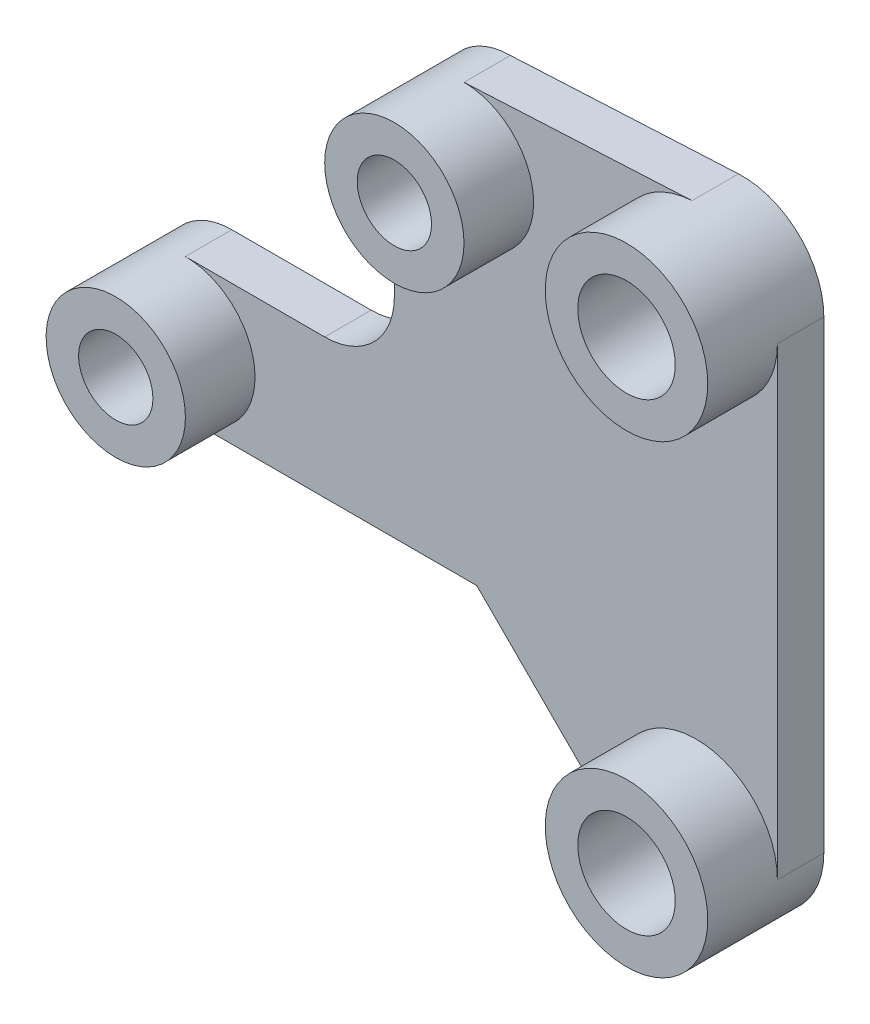
ISO-10303-21;
HEADER;
FILE_DESCRIPTION(('STEP AP214'),'2;1');
FILE_NAME('part.step','',(''),(''),'','','');
FILE_SCHEMA(('AUTOMOTIVE_DESIGN { 1 0 10303 214 1 1 1 1 }'));
ENDSEC;
DATA;
#1=APPLICATION_CONTEXT('core data for automotive mechanical design processes');
#2=APPLICATION_PROTOCOL_DEFINITION('international standard','automotive_design',2000,#1);
#3=PRODUCT_CONTEXT('',#1,'mechanical');
#4=PRODUCT('Part','Part','',(#3));
#5=PRODUCT_RELATED_PRODUCT_CATEGORY('part','',(#4));
#6=PRODUCT_DEFINITION_FORMATION('','',#4);
#7=PRODUCT_DEFINITION_CONTEXT('part definition',#1,'design');
#8=PRODUCT_DEFINITION('design','',#6,#7);
#9=PRODUCT_DEFINITION_SHAPE('','',#8);
#10=(LENGTH_UNIT() NAMED_UNIT(*) SI_UNIT(.MILLI.,.METRE.));
#11=(NAMED_UNIT(*) PLANE_ANGLE_UNIT() SI_UNIT($,.RADIAN.));
#12=(NAMED_UNIT(*) SI_UNIT($,.STERADIAN.) SOLID_ANGLE_UNIT());
#13=UNCERTAINTY_MEASURE_WITH_UNIT(LENGTH_MEASURE(1.E-05),#10,'distance_accuracy_value','');
#14=(GEOMETRIC_REPRESENTATION_CONTEXT(3) GLOBAL_UNCERTAINTY_ASSIGNED_CONTEXT((#13)) GLOBAL_UNIT_ASSIGNED_CONTEXT((#10,
#11,#12)) REPRESENTATION_CONTEXT('',''));
#15=CARTESIAN_POINT('',(0.,0.,0.));
#16=DIRECTION('',(0.,0.,1.));
#17=DIRECTION('',(1.,0.,0.));
#18=AXIS2_PLACEMENT_3D('',#15,#16,#17);
#19=CARTESIAN_POINT('',(22.,-7.5,2.));
#20=DIRECTION('',(0.,0.,1.));
#21=DIRECTION('',(1.,0.,0.));
#22=AXIS2_PLACEMENT_3D('',#19,#20,#21);
#23=PLANE('',#22);
#24=DIRECTION('',(0.707106781186546,-0.707106781186549,0.));
#25=VECTOR('',#24,1.);
#26=CARTESIAN_POINT('',(12.5502525316942,-3.,2.));
#27=LINE('',#26,#25);
#28=CARTESIAN_POINT('',(12.5502525316942,-3.,2.));
#29=VERTEX_POINT('',#28);
#30=CARTESIAN_POINT('',(19.5251262658471,-9.9748737341529,2.));
#31=VERTEX_POINT('',#30);
#32=EDGE_CURVE('E52',#29,#31,#27,.T.);
#33=ORIENTED_EDGE('',*,*,#32,.T.);
#34=CARTESIAN_POINT('',(22.,-7.5,2.));
#35=DIRECTION('',(0.,0.,1.));
#36=DIRECTION('',(1.,0.,0.));
#37=AXIS2_PLACEMENT_3D('',#34,#35,#36);
#38=CIRCLE('',#37,3.5);
#39=CARTESIAN_POINT('',(25.5,-7.5,2.));
#40=VERTEX_POINT('',#39);
#41=EDGE_CURVE('E218',#40,#31,#38,.T.);
#42=ORIENTED_EDGE('',*,*,#41,.F.);
#43=DIRECTION('',(0.,1.,0.));
#44=VECTOR('',#43,1.);
#45=CARTESIAN_POINT('',(25.5,12.5,2.));
#46=LINE('',#45,#44);
#47=CARTESIAN_POINT('',(25.5,12.5,2.));
#48=VERTEX_POINT('',#47);
#49=EDGE_CURVE('E103',#40,#48,#46,.T.);
#50=ORIENTED_EDGE('',*,*,#49,.T.);
#51=CARTESIAN_POINT('',(22.,12.5,2.));
#52=DIRECTION('',(0.,0.,1.));
#53=DIRECTION('',(1.,0.,0.));
#54=AXIS2_PLACEMENT_3D('',#51,#52,#53);
#55=CIRCLE('',#54,3.5);
#56=CARTESIAN_POINT('',(21.8236665757592,15.9955552525308,2.));
#57=VERTEX_POINT('',#56);
#58=EDGE_CURVE('E11',#48,#57,#55,.F.);
#59=ORIENTED_EDGE('',*,*,#58,.T.);
#60=DIRECTION('',(-0.998730072151651,-0.0503809783545027,0.));
#61=VECTOR('',#60,1.);
#62=CARTESIAN_POINT('',(12.,15.5,2.));
#63=LINE('',#62,#61);
#64=CARTESIAN_POINT('',(12.,15.5,2.));
#65=VERTEX_POINT('',#64);
#66=EDGE_CURVE('E195',#57,#65,#63,.T.);
#67=ORIENTED_EDGE('',*,*,#66,.T.);
#68=CARTESIAN_POINT('',(12.,12.5,2.));
#69=DIRECTION('',(0.,0.,1.));
#70=DIRECTION('',(1.,0.,0.));
#71=AXIS2_PLACEMENT_3D('',#68,#69,#70);
#72=CIRCLE('',#71,3.);
#73=CARTESIAN_POINT('',(9.,12.5,2.));
#74=VERTEX_POINT('',#73);
#75=EDGE_CURVE('E44',#65,#74,#72,.F.);
#76=ORIENTED_EDGE('',*,*,#75,.T.);
#77=DIRECTION('',(0.,-1.,0.));
#78=VECTOR('',#77,1.);
#79=CARTESIAN_POINT('',(9.,6.,2.));
#80=LINE('',#79,#78);
#81=CARTESIAN_POINT('',(9.,6.,2.));
#82=VERTEX_POINT('',#81);
#83=EDGE_CURVE('E191',#74,#82,#80,.T.);
#84=ORIENTED_EDGE('',*,*,#83,.T.);
#85=CARTESIAN_POINT('',(6.,6.,2.));
#86=DIRECTION('',(0.,0.,-1.));
#87=DIRECTION('',(1.,0.,0.));
#88=AXIS2_PLACEMENT_3D('',#85,#86,#87);
#89=CIRCLE('',#88,3.);
#90=CARTESIAN_POINT('',(6.,3.,2.));
#91=VERTEX_POINT('',#90);
#92=EDGE_CURVE('E140',#82,#91,#89,.T.);
#93=ORIENTED_EDGE('',*,*,#92,.T.);
#94=DIRECTION('',(-1.,0.,0.));
#95=VECTOR('',#94,1.);
#96=CARTESIAN_POINT('',(0.,3.,2.));
#97=LINE('',#96,#95);
#98=CARTESIAN_POINT('',(0.,3.,2.));
#99=VERTEX_POINT('',#98);
#100=EDGE_CURVE('E123',#91,#99,#97,.T.);
#101=ORIENTED_EDGE('',*,*,#100,.T.);
#102=CARTESIAN_POINT('',(0.,0.,2.));
#103=DIRECTION('',(0.,0.,1.));
#104=DIRECTION('',(1.,0.,0.));
#105=AXIS2_PLACEMENT_3D('',#102,#103,#104);
#106=CIRCLE('',#105,3.);
#107=CARTESIAN_POINT('',(0.,-3.,2.));
#108=VERTEX_POINT('',#107);
#109=EDGE_CURVE('E118',#108,#99,#106,.T.);
#110=ORIENTED_EDGE('',*,*,#109,.F.);
#111=DIRECTION('',(1.,0.,0.));
#112=VECTOR('',#111,1.);
#113=CARTESIAN_POINT('',(0.,-3.,2.));
#114=LINE('',#113,#112);
#115=EDGE_CURVE('E121',#108,#29,#114,.T.);
#116=ORIENTED_EDGE('',*,*,#115,.T.);
#117=EDGE_LOOP('',(#33,#42,#50,#59,#67,#76,#84,#93,#101,#110,#116));
#118=FACE_BOUND('',#117,.T.);
#119=ADVANCED_FACE('F35',(#118),#23,.T.);
#120=CARTESIAN_POINT('',(22.,-7.5,2.));
#121=DIRECTION('',(0.,0.,-1.));
#122=DIRECTION('',(-1.,0.,0.));
#123=AXIS2_PLACEMENT_3D('',#120,#121,#122);
#124=CYLINDRICAL_SURFACE('',#123,3.49999999999998);
#125=CARTESIAN_POINT('',(22.,-7.5,0.));
#126=DIRECTION('',(0.,0.,1.));
#127=DIRECTION('',(1.,0.,0.));
#128=AXIS2_PLACEMENT_3D('',#125,#126,#127);
#129=CIRCLE('',#128,3.49999999999998);
#130=CARTESIAN_POINT('',(19.5251262658471,-9.9748737341529,0.));
#131=VERTEX_POINT('',#130);
#132=CARTESIAN_POINT('',(25.5,-7.5,0.));
#133=VERTEX_POINT('',#132);
#134=EDGE_CURVE('E144',#131,#133,#129,.T.);
#135=ORIENTED_EDGE('',*,*,#134,.T.);
#136=DIRECTION('',(0.,0.,-1.));
#137=VECTOR('',#136,1.);
#138=CARTESIAN_POINT('',(25.5,-7.5,2.));
#139=LINE('',#138,#137);
#140=EDGE_CURVE('E126',#40,#133,#139,.T.);
#141=ORIENTED_EDGE('',*,*,#140,.F.);
#142=ORIENTED_EDGE('',*,*,#41,.T.);
#143=DIRECTION('',(0.,0.,-1.));
#144=VECTOR('',#143,1.);
#145=CARTESIAN_POINT('',(19.5251262658471,-9.9748737341529,2.));
#146=LINE('',#145,#144);
#147=EDGE_CURVE('E138',#31,#131,#146,.T.);
#148=ORIENTED_EDGE('',*,*,#147,.T.);
#149=EDGE_LOOP('',(#135,#141,#142,#148));
#150=FACE_BOUND('',#149,.T.);
#151=CARTESIAN_POINT('',(22.,-7.5,5.));
#152=DIRECTION('',(0.,0.,1.));
#153=DIRECTION('',(1.,0.,0.));
#154=AXIS2_PLACEMENT_3D('',#151,#152,#153);
#155=CIRCLE('',#154,3.5);
#156=CARTESIAN_POINT('',(25.5,-7.5,5.));
#157=VERTEX_POINT('',#156);
#158=EDGE_CURVE('E217',#157,#157,#155,.T.);
#159=ORIENTED_EDGE('',*,*,#158,.F.);
#160=EDGE_LOOP('',(#159));
#161=FACE_BOUND('',#160,.T.);
#162=ADVANCED_FACE('F37',(#150,#161),#124,.T.);
#163=CARTESIAN_POINT('',(25.5,12.5,2.));
#164=DIRECTION('',(-1.,0.,0.));
#165=DIRECTION('',(0.,-1.,0.));
#166=AXIS2_PLACEMENT_3D('',#163,#164,#165);
#167=PLANE('',#166);
#168=DIRECTION('',(0.,1.,0.));
#169=VECTOR('',#168,1.);
#170=CARTESIAN_POINT('',(25.5,12.5,0.));
#171=LINE('',#170,#169);
#172=CARTESIAN_POINT('',(25.5,12.5,0.));
#173=VERTEX_POINT('',#172);
#174=EDGE_CURVE('E147',#133,#173,#171,.T.);
#175=ORIENTED_EDGE('',*,*,#174,.T.);
#176=DIRECTION('',(0.,0.,-1.));
#177=VECTOR('',#176,1.);
#178=CARTESIAN_POINT('',(25.5,12.5,2.));
#179=LINE('',#178,#177);
#180=EDGE_CURVE('E183',#48,#173,#179,.T.);
#181=ORIENTED_EDGE('',*,*,#180,.F.);
#182=ORIENTED_EDGE('',*,*,#49,.F.);
#183=ORIENTED_EDGE('',*,*,#140,.T.);
#184=EDGE_LOOP('',(#175,#181,#182,#183));
#185=FACE_BOUND('',#184,.T.);
#186=ADVANCED_FACE('F281',(#185),#167,.F.);
#187=CARTESIAN_POINT('',(22.,12.5,2.));
#188=DIRECTION('',(0.,0.,-1.));
#189=DIRECTION('',(-1.,0.,0.));
#190=AXIS2_PLACEMENT_3D('',#187,#188,#189);
#191=CYLINDRICAL_SURFACE('',#190,3.49999999999998);
#192=CARTESIAN_POINT('',(22.,12.5,0.));
#193=DIRECTION('',(0.,0.,1.));
#194=DIRECTION('',(1.,0.,0.));
#195=AXIS2_PLACEMENT_3D('',#192,#193,#194);
#196=CIRCLE('',#195,3.49999999999998);
#197=CARTESIAN_POINT('',(21.8236665757592,15.9955552525308,0.));
#198=VERTEX_POINT('',#197);
#199=EDGE_CURVE('E150',#173,#198,#196,.T.);
#200=ORIENTED_EDGE('',*,*,#199,.T.);
#201=DIRECTION('',(0.,0.,-1.));
#202=VECTOR('',#201,1.);
#203=CARTESIAN_POINT('',(21.8236665757592,15.9955552525308,2.));
#204=LINE('',#203,#202);
#205=EDGE_CURVE('E180',#57,#198,#204,.T.);
#206=ORIENTED_EDGE('',*,*,#205,.F.);
#207=ORIENTED_EDGE('',*,*,#58,.F.);
#208=ORIENTED_EDGE('',*,*,#180,.T.);
#209=EDGE_LOOP('',(#200,#206,#207,#208));
#210=FACE_BOUND('',#209,.T.);
#211=CARTESIAN_POINT('',(22.,12.5,5.));
#212=DIRECTION('',(0.,0.,1.));
#213=DIRECTION('',(1.,0.,0.));
#214=AXIS2_PLACEMENT_3D('',#211,#212,#213);
#215=CIRCLE('',#214,3.5);
#216=CARTESIAN_POINT('',(25.5,12.5,5.));
#217=VERTEX_POINT('',#216);
#218=EDGE_CURVE('E214',#217,#217,#215,.T.);
#219=ORIENTED_EDGE('',*,*,#218,.F.);
#220=EDGE_LOOP('',(#219));
#221=FACE_BOUND('',#220,.T.);
#222=ADVANCED_FACE('F392',(#210,#221),#191,.T.);
#223=CARTESIAN_POINT('',(12.,15.5,2.));
#224=DIRECTION('',(0.0503809783545027,-0.998730072151652,0.));
#225=DIRECTION('',(0.998730072151652,0.0503809783545027,0.));
#226=AXIS2_PLACEMENT_3D('',#223,#224,#225);
#227=PLANE('',#226);
#228=DIRECTION('',(-0.998730072151651,-0.0503809783545027,0.));
#229=VECTOR('',#228,1.);
#230=CARTESIAN_POINT('',(12.,15.5,0.));
#231=LINE('',#230,#229);
#232=CARTESIAN_POINT('',(12.,15.5,0.));
#233=VERTEX_POINT('',#232);
#234=EDGE_CURVE('E152',#198,#233,#231,.T.);
#235=ORIENTED_EDGE('',*,*,#234,.T.);
#236=DIRECTION('',(0.,0.,-1.));
#237=VECTOR('',#236,1.);
#238=CARTESIAN_POINT('',(12.,15.5,2.));
#239=LINE('',#238,#237);
#240=EDGE_CURVE('E177',#65,#233,#239,.T.);
#241=ORIENTED_EDGE('',*,*,#240,.F.);
#242=ORIENTED_EDGE('',*,*,#66,.F.);
#243=ORIENTED_EDGE('',*,*,#205,.T.);
#244=EDGE_LOOP('',(#235,#241,#242,#243));
#245=FACE_BOUND('',#244,.T.);
#246=ADVANCED_FACE('F384',(#245),#227,.F.);
#247=CARTESIAN_POINT('',(12.,12.5,2.));
#248=DIRECTION('',(0.,0.,-1.));
#249=DIRECTION('',(-1.,0.,0.));
#250=AXIS2_PLACEMENT_3D('',#247,#248,#249);
#251=CYLINDRICAL_SURFACE('',#250,3.);
#252=CARTESIAN_POINT('',(12.,12.5,0.));
#253=DIRECTION('',(0.,0.,1.));
#254=DIRECTION('',(1.,0.,0.));
#255=AXIS2_PLACEMENT_3D('',#252,#253,#254);
#256=CIRCLE('',#255,3.);
#257=CARTESIAN_POINT('',(9.,12.5,0.));
#258=VERTEX_POINT('',#257);
#259=EDGE_CURVE('E154',#233,#258,#256,.T.);
#260=ORIENTED_EDGE('',*,*,#259,.T.);
#261=DIRECTION('',(0.,0.,-1.));
#262=VECTOR('',#261,1.);
#263=CARTESIAN_POINT('',(9.,12.5,2.));
#264=LINE('',#263,#262);
#265=EDGE_CURVE('E174',#74,#258,#264,.T.);
#266=ORIENTED_EDGE('',*,*,#265,.F.);
#267=ORIENTED_EDGE('',*,*,#75,.F.);
#268=ORIENTED_EDGE('',*,*,#240,.T.);
#269=EDGE_LOOP('',(#260,#266,#267,#268));
#270=FACE_BOUND('',#269,.T.);
#271=CARTESIAN_POINT('',(12.,12.5,5.));
#272=DIRECTION('',(0.,0.,1.));
#273=DIRECTION('',(1.,0.,0.));
#274=AXIS2_PLACEMENT_3D('',#271,#272,#273);
#275=CIRCLE('',#274,3.);
#276=CARTESIAN_POINT('',(15.,12.5,5.));
#277=VERTEX_POINT('',#276);
#278=EDGE_CURVE('E211',#277,#277,#275,.T.);
#279=ORIENTED_EDGE('',*,*,#278,.F.);
#280=EDGE_LOOP('',(#279));
#281=FACE_BOUND('',#280,.T.);
#282=ADVANCED_FACE('F198',(#270,#281),#251,.T.);
#283=CARTESIAN_POINT('',(9.,6.,2.));
#284=DIRECTION('',(1.,0.,0.));
#285=DIRECTION('',(0.,1.,0.));
#286=AXIS2_PLACEMENT_3D('',#283,#284,#285);
#287=PLANE('',#286);
#288=DIRECTION('',(0.,-1.,0.));
#289=VECTOR('',#288,1.);
#290=CARTESIAN_POINT('',(9.,6.,0.));
#291=LINE('',#290,#289);
#292=CARTESIAN_POINT('',(9.,6.,0.));
#293=VERTEX_POINT('',#292);
#294=EDGE_CURVE('E156',#258,#293,#291,.T.);
#295=ORIENTED_EDGE('',*,*,#294,.T.);
#296=DIRECTION('',(0.,0.,-1.));
#297=VECTOR('',#296,1.);
#298=CARTESIAN_POINT('',(9.,6.,2.));
#299=LINE('',#298,#297);
#300=EDGE_CURVE('E171',#82,#293,#299,.T.);
#301=ORIENTED_EDGE('',*,*,#300,.F.);
#302=ORIENTED_EDGE('',*,*,#83,.F.);
#303=ORIENTED_EDGE('',*,*,#265,.T.);
#304=EDGE_LOOP('',(#295,#301,#302,#303));
#305=FACE_BOUND('',#304,.T.);
#306=ADVANCED_FACE('F203',(#305),#287,.F.);
#307=CARTESIAN_POINT('',(6.,6.,2.));
#308=DIRECTION('',(0.,0.,-1.));
#309=DIRECTION('',(-1.,0.,0.));
#310=AXIS2_PLACEMENT_3D('',#307,#308,#309);
#311=CYLINDRICAL_SURFACE('',#310,3.);
#312=CARTESIAN_POINT('',(6.,6.,0.));
#313=DIRECTION('',(0.,0.,-1.));
#314=DIRECTION('',(1.,0.,0.));
#315=AXIS2_PLACEMENT_3D('',#312,#313,#314);
#316=CIRCLE('',#315,3.);
#317=CARTESIAN_POINT('',(6.,3.,0.));
#318=VERTEX_POINT('',#317);
#319=EDGE_CURVE('E158',#293,#318,#316,.T.);
#320=ORIENTED_EDGE('',*,*,#319,.T.);
#321=DIRECTION('',(0.,0.,-1.));
#322=VECTOR('',#321,1.);
#323=CARTESIAN_POINT('',(6.,3.,2.));
#324=LINE('',#323,#322);
#325=EDGE_CURVE('E168',#91,#318,#324,.T.);
#326=ORIENTED_EDGE('',*,*,#325,.F.);
#327=ORIENTED_EDGE('',*,*,#92,.F.);
#328=ORIENTED_EDGE('',*,*,#300,.T.);
#329=EDGE_LOOP('',(#320,#326,#327,#328));
#330=FACE_BOUND('',#329,.T.);
#331=ADVANCED_FACE('F273',(#330),#311,.F.);
#332=CARTESIAN_POINT('',(0.,3.,2.));
#333=DIRECTION('',(0.,-1.,0.));
#334=DIRECTION('',(1.,0.,0.));
#335=AXIS2_PLACEMENT_3D('',#332,#333,#334);
#336=PLANE('',#335);
#337=DIRECTION('',(-1.,0.,0.));
#338=VECTOR('',#337,1.);
#339=CARTESIAN_POINT('',(0.,3.,0.));
#340=LINE('',#339,#338);
#341=CARTESIAN_POINT('',(0.,3.,0.));
#342=VERTEX_POINT('',#341);
#343=EDGE_CURVE('E160',#318,#342,#340,.T.);
#344=ORIENTED_EDGE('',*,*,#343,.T.);
#345=DIRECTION('',(0.,0.,-1.));
#346=VECTOR('',#345,1.);
#347=CARTESIAN_POINT('',(0.,3.,2.));
#348=LINE('',#347,#346);
#349=EDGE_CURVE('E133',#99,#342,#348,.T.);
#350=ORIENTED_EDGE('',*,*,#349,.F.);
#351=ORIENTED_EDGE('',*,*,#100,.F.);
#352=ORIENTED_EDGE('',*,*,#325,.T.);
#353=EDGE_LOOP('',(#344,#350,#351,#352));
#354=FACE_BOUND('',#353,.T.);
#355=ADVANCED_FACE('F265',(#354),#336,.F.);
#356=CARTESIAN_POINT('',(0.,0.,2.));
#357=DIRECTION('',(0.,0.,-1.));
#358=DIRECTION('',(-1.,0.,0.));
#359=AXIS2_PLACEMENT_3D('',#356,#357,#358);
#360=CYLINDRICAL_SURFACE('',#359,3.);
#361=CARTESIAN_POINT('',(0.,0.,0.));
#362=DIRECTION('',(0.,0.,1.));
#363=DIRECTION('',(1.,0.,0.));
#364=AXIS2_PLACEMENT_3D('',#361,#362,#363);
#365=CIRCLE('',#364,3.);
#366=CARTESIAN_POINT('',(0.,-3.,0.));
#367=VERTEX_POINT('',#366);
#368=EDGE_CURVE('E132',#342,#367,#365,.T.);
#369=ORIENTED_EDGE('',*,*,#368,.T.);
#370=DIRECTION('',(0.,0.,-1.));
#371=VECTOR('',#370,1.);
#372=CARTESIAN_POINT('',(0.,-3.,2.));
#373=LINE('',#372,#371);
#374=EDGE_CURVE('E128',#108,#367,#373,.T.);
#375=ORIENTED_EDGE('',*,*,#374,.F.);
#376=ORIENTED_EDGE('',*,*,#109,.T.);
#377=ORIENTED_EDGE('',*,*,#349,.T.);
#378=EDGE_LOOP('',(#369,#375,#376,#377));
#379=FACE_BOUND('',#378,.T.);
#380=CARTESIAN_POINT('',(0.,0.,5.));
#381=DIRECTION('',(0.,0.,1.));
#382=DIRECTION('',(1.,0.,0.));
#383=AXIS2_PLACEMENT_3D('',#380,#381,#382);
#384=CIRCLE('',#383,3.);
#385=CARTESIAN_POINT('',(3.,0.,5.));
#386=VERTEX_POINT('',#385);
#387=EDGE_CURVE('E148',#386,#386,#384,.T.);
#388=ORIENTED_EDGE('',*,*,#387,.F.);
#389=EDGE_LOOP('',(#388));
#390=FACE_BOUND('',#389,.T.);
#391=ADVANCED_FACE('F129',(#379,#390),#360,.T.);
#392=CARTESIAN_POINT('',(0.,-3.,2.));
#393=DIRECTION('',(0.,1.,0.));
#394=DIRECTION('',(-1.,0.,0.));
#395=AXIS2_PLACEMENT_3D('',#392,#393,#394);
#396=PLANE('',#395);
#397=DIRECTION('',(1.,0.,0.));
#398=VECTOR('',#397,1.);
#399=CARTESIAN_POINT('',(0.,-3.,0.));
#400=LINE('',#399,#398);
#401=CARTESIAN_POINT('',(12.5502525316942,-3.,0.));
#402=VERTEX_POINT('',#401);
#403=EDGE_CURVE('E91',#367,#402,#400,.T.);
#404=ORIENTED_EDGE('',*,*,#403,.T.);
#405=DIRECTION('',(0.,0.,-1.));
#406=VECTOR('',#405,1.);
#407=CARTESIAN_POINT('',(12.5502525316942,-3.,2.));
#408=LINE('',#407,#406);
#409=EDGE_CURVE('E134',#29,#402,#408,.T.);
#410=ORIENTED_EDGE('',*,*,#409,.F.);
#411=ORIENTED_EDGE('',*,*,#115,.F.);
#412=ORIENTED_EDGE('',*,*,#374,.T.);
#413=EDGE_LOOP('',(#404,#410,#411,#412));
#414=FACE_BOUND('',#413,.T.);
#415=ADVANCED_FACE('F136',(#414),#396,.F.);
#416=CARTESIAN_POINT('',(12.5502525316942,-3.,2.));
#417=DIRECTION('',(0.707106781186549,0.707106781186546,0.));
#418=DIRECTION('',(-0.707106781186546,0.707106781186549,0.));
#419=AXIS2_PLACEMENT_3D('',#416,#417,#418);
#420=PLANE('',#419);
#421=DIRECTION('',(0.707106781186546,-0.707106781186549,0.));
#422=VECTOR('',#421,1.);
#423=CARTESIAN_POINT('',(12.5502525316942,-3.,0.));
#424=LINE('',#423,#422);
#425=EDGE_CURVE('E97',#402,#131,#424,.T.);
#426=ORIENTED_EDGE('',*,*,#425,.T.);
#427=ORIENTED_EDGE('',*,*,#147,.F.);
#428=ORIENTED_EDGE('',*,*,#32,.F.);
#429=ORIENTED_EDGE('',*,*,#409,.T.);
#430=EDGE_LOOP('',(#426,#427,#428,#429));
#431=FACE_BOUND('',#430,.T.);
#432=ADVANCED_FACE('F271',(#431),#420,.F.);
#433=CARTESIAN_POINT('',(22.,-7.5,0.));
#434=DIRECTION('',(0.,0.,1.));
#435=DIRECTION('',(1.,0.,0.));
#436=AXIS2_PLACEMENT_3D('',#433,#434,#435);
#437=PLANE('',#436);
#438=CARTESIAN_POINT('',(0.,0.,0.));
#439=DIRECTION('',(0.,0.,1.));
#440=DIRECTION('',(1.,0.,0.));
#441=AXIS2_PLACEMENT_3D('',#438,#439,#440);
#442=CIRCLE('',#441,1.6);
#443=CARTESIAN_POINT('',(1.6,0.,0.));
#444=VERTEX_POINT('',#443);
#445=EDGE_CURVE('E221',#444,#444,#442,.T.);
#446=ORIENTED_EDGE('',*,*,#445,.T.);
#447=EDGE_LOOP('',(#446));
#448=FACE_BOUND('',#447,.T.);
#449=CARTESIAN_POINT('',(12.,12.5,0.));
#450=DIRECTION('',(0.,0.,1.));
#451=DIRECTION('',(1.,0.,0.));
#452=AXIS2_PLACEMENT_3D('',#449,#450,#451);
#453=CIRCLE('',#452,1.6);
#454=CARTESIAN_POINT('',(13.6,12.5,0.));
#455=VERTEX_POINT('',#454);
#456=EDGE_CURVE('E239',#455,#455,#453,.T.);
#457=ORIENTED_EDGE('',*,*,#456,.T.);
#458=EDGE_LOOP('',(#457));
#459=FACE_BOUND('',#458,.T.);
#460=CARTESIAN_POINT('',(22.,12.5,0.));
#461=DIRECTION('',(0.,0.,1.));
#462=DIRECTION('',(1.,0.,0.));
#463=AXIS2_PLACEMENT_3D('',#460,#461,#462);
#464=CIRCLE('',#463,2.1);
#465=CARTESIAN_POINT('',(24.1,12.5,0.));
#466=VERTEX_POINT('',#465);
#467=EDGE_CURVE('E233',#466,#466,#464,.T.);
#468=ORIENTED_EDGE('',*,*,#467,.T.);
#469=EDGE_LOOP('',(#468));
#470=FACE_BOUND('',#469,.T.);
#471=CARTESIAN_POINT('',(22.,-7.5,0.));
#472=DIRECTION('',(0.,0.,1.));
#473=DIRECTION('',(1.,0.,0.));
#474=AXIS2_PLACEMENT_3D('',#471,#472,#473);
#475=CIRCLE('',#474,2.1);
#476=CARTESIAN_POINT('',(24.1,-7.5,0.));
#477=VERTEX_POINT('',#476);
#478=EDGE_CURVE('E227',#477,#477,#475,.T.);
#479=ORIENTED_EDGE('',*,*,#478,.T.);
#480=EDGE_LOOP('',(#479));
#481=FACE_BOUND('',#480,.T.);
#482=ORIENTED_EDGE('',*,*,#134,.F.);
#483=ORIENTED_EDGE('',*,*,#425,.F.);
#484=ORIENTED_EDGE('',*,*,#403,.F.);
#485=ORIENTED_EDGE('',*,*,#368,.F.);
#486=ORIENTED_EDGE('',*,*,#343,.F.);
#487=ORIENTED_EDGE('',*,*,#319,.F.);
#488=ORIENTED_EDGE('',*,*,#294,.F.);
#489=ORIENTED_EDGE('',*,*,#259,.F.);
#490=ORIENTED_EDGE('',*,*,#234,.F.);
#491=ORIENTED_EDGE('',*,*,#199,.F.);
#492=ORIENTED_EDGE('',*,*,#174,.F.);
#493=EDGE_LOOP('',(#482,#483,#484,#485,#486,#487,#488,#489,#490,#491,#492));
#494=FACE_BOUND('',#493,.T.);
#495=ADVANCED_FACE('F248',(#448,#459,#470,#481,#494),#437,.F.);
#496=CARTESIAN_POINT('',(0.,0.,5.));
#497=DIRECTION('',(0.,0.,1.));
#498=DIRECTION('',(1.,0.,0.));
#499=AXIS2_PLACEMENT_3D('',#496,#497,#498);
#500=PLANE('',#499);
#501=CARTESIAN_POINT('',(0.,0.,5.));
#502=DIRECTION('',(0.,0.,1.));
#503=DIRECTION('',(1.,0.,0.));
#504=AXIS2_PLACEMENT_3D('',#501,#502,#503);
#505=CIRCLE('',#504,1.6);
#506=CARTESIAN_POINT('',(1.6,0.,5.));
#507=VERTEX_POINT('',#506);
#508=EDGE_CURVE('E242',#507,#507,#505,.T.);
#509=ORIENTED_EDGE('',*,*,#508,.F.);
#510=EDGE_LOOP('',(#509));
#511=FACE_BOUND('',#510,.T.);
#512=ORIENTED_EDGE('',*,*,#387,.T.);
#513=EDGE_LOOP('',(#512));
#514=FACE_BOUND('',#513,.T.);
#515=ADVANCED_FACE('F258',(#511,#514),#500,.T.);
#516=CARTESIAN_POINT('',(12.,12.5,5.));
#517=DIRECTION('',(0.,0.,1.));
#518=DIRECTION('',(1.,0.,0.));
#519=AXIS2_PLACEMENT_3D('',#516,#517,#518);
#520=PLANE('',#519);
#521=CARTESIAN_POINT('',(12.,12.5,5.));
#522=DIRECTION('',(0.,0.,1.));
#523=DIRECTION('',(1.,0.,0.));
#524=AXIS2_PLACEMENT_3D('',#521,#522,#523);
#525=CIRCLE('',#524,1.6);
#526=CARTESIAN_POINT('',(13.6,12.5,5.));
#527=VERTEX_POINT('',#526);
#528=EDGE_CURVE('E236',#527,#527,#525,.T.);
#529=ORIENTED_EDGE('',*,*,#528,.F.);
#530=EDGE_LOOP('',(#529));
#531=FACE_BOUND('',#530,.T.);
#532=ORIENTED_EDGE('',*,*,#278,.T.);
#533=EDGE_LOOP('',(#532));
#534=FACE_BOUND('',#533,.T.);
#535=ADVANCED_FACE('F261',(#531,#534),#520,.T.);
#536=CARTESIAN_POINT('',(22.,12.5,5.));
#537=DIRECTION('',(0.,0.,1.));
#538=DIRECTION('',(1.,0.,0.));
#539=AXIS2_PLACEMENT_3D('',#536,#537,#538);
#540=PLANE('',#539);
#541=CARTESIAN_POINT('',(22.,12.5,5.));
#542=DIRECTION('',(0.,0.,1.));
#543=DIRECTION('',(1.,0.,0.));
#544=AXIS2_PLACEMENT_3D('',#541,#542,#543);
#545=CIRCLE('',#544,2.1);
#546=CARTESIAN_POINT('',(24.1,12.5,5.));
#547=VERTEX_POINT('',#546);
#548=EDGE_CURVE('E230',#547,#547,#545,.T.);
#549=ORIENTED_EDGE('',*,*,#548,.F.);
#550=EDGE_LOOP('',(#549));
#551=FACE_BOUND('',#550,.T.);
#552=ORIENTED_EDGE('',*,*,#218,.T.);
#553=EDGE_LOOP('',(#552));
#554=FACE_BOUND('',#553,.T.);
#555=ADVANCED_FACE('F306',(#551,#554),#540,.T.);
#556=CARTESIAN_POINT('',(22.,-7.5,5.));
#557=DIRECTION('',(0.,0.,1.));
#558=DIRECTION('',(1.,0.,0.));
#559=AXIS2_PLACEMENT_3D('',#556,#557,#558);
#560=PLANE('',#559);
#561=CARTESIAN_POINT('',(22.,-7.5,5.));
#562=DIRECTION('',(0.,0.,1.));
#563=DIRECTION('',(1.,0.,0.));
#564=AXIS2_PLACEMENT_3D('',#561,#562,#563);
#565=CIRCLE('',#564,2.1);
#566=CARTESIAN_POINT('',(24.1,-7.5,5.));
#567=VERTEX_POINT('',#566);
#568=EDGE_CURVE('E224',#567,#567,#565,.T.);
#569=ORIENTED_EDGE('',*,*,#568,.F.);
#570=EDGE_LOOP('',(#569));
#571=FACE_BOUND('',#570,.T.);
#572=ORIENTED_EDGE('',*,*,#158,.T.);
#573=EDGE_LOOP('',(#572));
#574=FACE_BOUND('',#573,.T.);
#575=ADVANCED_FACE('F313',(#571,#574),#560,.T.);
#576=CARTESIAN_POINT('',(22.,-7.5,0.));
#577=DIRECTION('',(0.,0.,1.));
#578=DIRECTION('',(1.,0.,0.));
#579=AXIS2_PLACEMENT_3D('',#576,#577,#578);
#580=CYLINDRICAL_SURFACE('',#579,2.1);
#581=ORIENTED_EDGE('',*,*,#478,.F.);
#582=EDGE_LOOP('',(#581));
#583=FACE_BOUND('',#582,.T.);
#584=ORIENTED_EDGE('',*,*,#568,.T.);
#585=EDGE_LOOP('',(#584));
#586=FACE_BOUND('',#585,.T.);
#587=ADVANCED_FACE('F321',(#583,#586),#580,.F.);
#588=CARTESIAN_POINT('',(22.,12.5,0.));
#589=DIRECTION('',(0.,0.,1.));
#590=DIRECTION('',(1.,0.,0.));
#591=AXIS2_PLACEMENT_3D('',#588,#589,#590);
#592=CYLINDRICAL_SURFACE('',#591,2.1);
#593=ORIENTED_EDGE('',*,*,#467,.F.);
#594=EDGE_LOOP('',(#593));
#595=FACE_BOUND('',#594,.T.);
#596=ORIENTED_EDGE('',*,*,#548,.T.);
#597=EDGE_LOOP('',(#596));
#598=FACE_BOUND('',#597,.T.);
#599=ADVANCED_FACE('F329',(#595,#598),#592,.F.);
#600=CARTESIAN_POINT('',(12.,12.5,0.));
#601=DIRECTION('',(0.,0.,1.));
#602=DIRECTION('',(1.,0.,0.));
#603=AXIS2_PLACEMENT_3D('',#600,#601,#602);
#604=CYLINDRICAL_SURFACE('',#603,1.6);
#605=ORIENTED_EDGE('',*,*,#456,.F.);
#606=EDGE_LOOP('',(#605));
#607=FACE_BOUND('',#606,.T.);
#608=ORIENTED_EDGE('',*,*,#528,.T.);
#609=EDGE_LOOP('',(#608));
#610=FACE_BOUND('',#609,.T.);
#611=ADVANCED_FACE('F254',(#607,#610),#604,.F.);
#612=CARTESIAN_POINT('',(0.,0.,0.));
#613=DIRECTION('',(0.,0.,1.));
#614=DIRECTION('',(1.,0.,0.));
#615=AXIS2_PLACEMENT_3D('',#612,#613,#614);
#616=CYLINDRICAL_SURFACE('',#615,1.6);
#617=ORIENTED_EDGE('',*,*,#445,.F.);
#618=EDGE_LOOP('',(#617));
#619=FACE_BOUND('',#618,.T.);
#620=ORIENTED_EDGE('',*,*,#508,.T.);
#621=EDGE_LOOP('',(#620));
#622=FACE_BOUND('',#621,.T.);
#623=ADVANCED_FACE('F251',(#619,#622),#616,.F.);
#624=CLOSED_SHELL('',(#119,#162,#186,#222,#246,#282,#306,#331,#355,#391,#415,#432,#495,#515,
#535,#555,#575,#587,#599,#611,#623));
#625=MANIFOLD_SOLID_BREP('B2',#624);
#626=ADVANCED_BREP_SHAPE_REPRESENTATION('',(#18,#625),#14);
#627=SHAPE_DEFINITION_REPRESENTATION(#9,#626);
ENDSEC;
END-ISO-10303-21;
